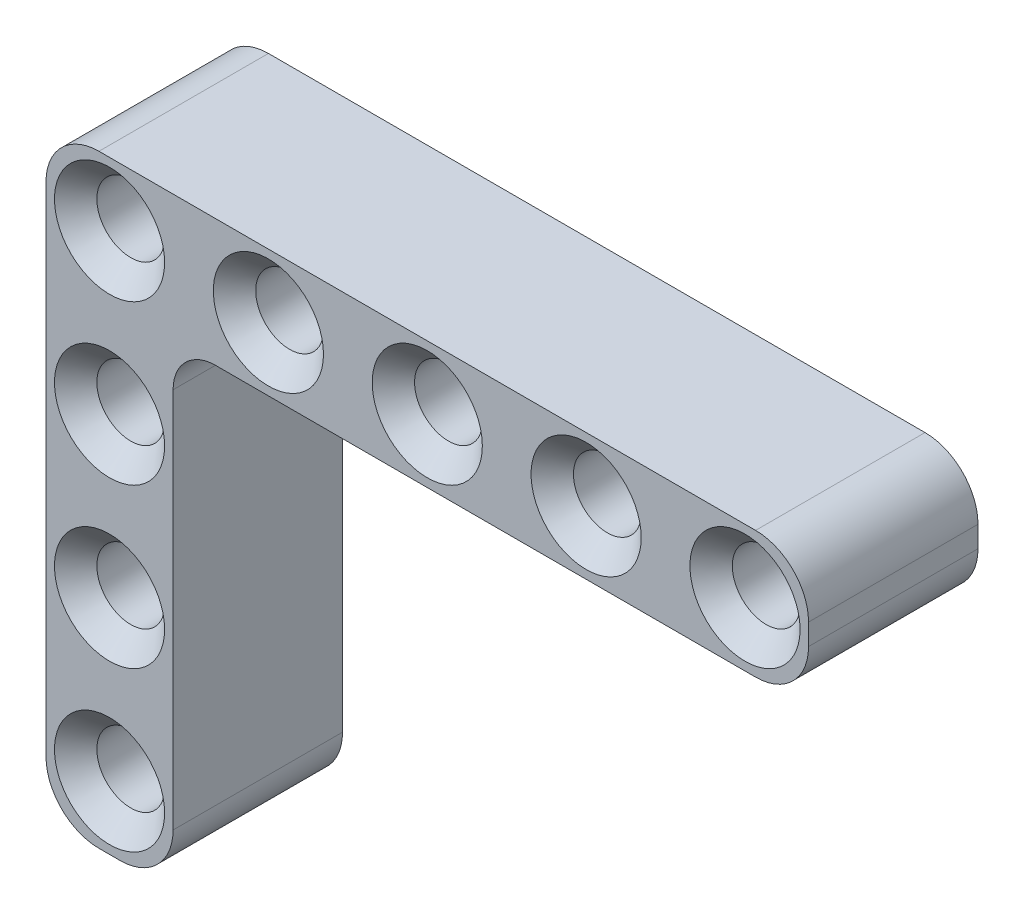
ISO-10303-21;
HEADER;
FILE_DESCRIPTION(('STEP AP214'),'2;1');
FILE_NAME('part.step','',(''),(''),'','','');
FILE_SCHEMA(('AUTOMOTIVE_DESIGN { 1 0 10303 214 1 1 1 1 }'));
ENDSEC;
DATA;
#1=APPLICATION_CONTEXT('core data for automotive mechanical design processes');
#2=APPLICATION_PROTOCOL_DEFINITION('international standard','automotive_design',2000,#1);
#3=PRODUCT_CONTEXT('',#1,'mechanical');
#4=PRODUCT('Part','Part','',(#3));
#5=PRODUCT_RELATED_PRODUCT_CATEGORY('part','',(#4));
#6=PRODUCT_DEFINITION_FORMATION('','',#4);
#7=PRODUCT_DEFINITION_CONTEXT('part definition',#1,'design');
#8=PRODUCT_DEFINITION('design','',#6,#7);
#9=PRODUCT_DEFINITION_SHAPE('','',#8);
#10=(LENGTH_UNIT() NAMED_UNIT(*) SI_UNIT(.MILLI.,.METRE.));
#11=(NAMED_UNIT(*) PLANE_ANGLE_UNIT() SI_UNIT($,.RADIAN.));
#12=(NAMED_UNIT(*) SI_UNIT($,.STERADIAN.) SOLID_ANGLE_UNIT());
#13=UNCERTAINTY_MEASURE_WITH_UNIT(LENGTH_MEASURE(1.E-05),#10,'distance_accuracy_value','');
#14=(GEOMETRIC_REPRESENTATION_CONTEXT(3) GLOBAL_UNCERTAINTY_ASSIGNED_CONTEXT((#13)) GLOBAL_UNIT_ASSIGNED_CONTEXT((#10,
#11,#12)) REPRESENTATION_CONTEXT('',''));
#15=CARTESIAN_POINT('',(0.,0.,0.));
#16=DIRECTION('',(0.,0.,1.));
#17=DIRECTION('',(1.,0.,0.));
#18=AXIS2_PLACEMENT_3D('',#15,#16,#17);
#19=CARTESIAN_POINT('',(30.5,-0.5,8.));
#20=DIRECTION('',(0.,0.,1.));
#21=DIRECTION('',(1.,0.,0.));
#22=AXIS2_PLACEMENT_3D('',#19,#20,#21);
#23=PLANE('',#22);
#24=CARTESIAN_POINT('',(0.,-7.5,8.));
#25=DIRECTION('',(0.,0.,1.));
#26=DIRECTION('',(1.,0.,0.));
#27=AXIS2_PLACEMENT_3D('',#24,#25,#26);
#28=CIRCLE('',#27,2.60000000000001);
#29=CARTESIAN_POINT('',(2.60000000000004,-7.5,8.));
#30=VERTEX_POINT('',#29);
#31=EDGE_CURVE('E294',#30,#30,#28,.F.);
#32=ORIENTED_EDGE('',*,*,#31,.T.);
#33=EDGE_LOOP('',(#32));
#34=FACE_BOUND('',#33,.T.);
#35=CARTESIAN_POINT('',(1.10050857315969E-13,-15.,8.));
#36=DIRECTION('',(0.,0.,1.));
#37=DIRECTION('',(1.,0.,0.));
#38=AXIS2_PLACEMENT_3D('',#35,#36,#37);
#39=CIRCLE('',#38,2.6);
#40=CARTESIAN_POINT('',(2.60000000000012,-15.,8.));
#41=VERTEX_POINT('',#40);
#42=EDGE_CURVE('E291',#41,#41,#39,.F.);
#43=ORIENTED_EDGE('',*,*,#42,.T.);
#44=EDGE_LOOP('',(#43));
#45=FACE_BOUND('',#44,.T.);
#46=CARTESIAN_POINT('',(1.88609187439939E-13,-22.5,8.));
#47=DIRECTION('',(0.,0.,1.));
#48=DIRECTION('',(1.,0.,0.));
#49=AXIS2_PLACEMENT_3D('',#46,#47,#48);
#50=CIRCLE('',#49,2.60000000000001);
#51=CARTESIAN_POINT('',(2.6000000000002,-22.5,8.));
#52=VERTEX_POINT('',#51);
#53=EDGE_CURVE('E288',#52,#52,#50,.F.);
#54=ORIENTED_EDGE('',*,*,#53,.T.);
#55=EDGE_LOOP('',(#54));
#56=FACE_BOUND('',#55,.T.);
#57=CARTESIAN_POINT('',(30.,0.,8.));
#58=DIRECTION('',(0.,0.,1.));
#59=DIRECTION('',(1.,0.,0.));
#60=AXIS2_PLACEMENT_3D('',#57,#58,#59);
#61=CIRCLE('',#60,2.6);
#62=CARTESIAN_POINT('',(32.6,0.,8.));
#63=VERTEX_POINT('',#62);
#64=EDGE_CURVE('E248',#63,#63,#61,.F.);
#65=ORIENTED_EDGE('',*,*,#64,.T.);
#66=EDGE_LOOP('',(#65));
#67=FACE_BOUND('',#66,.T.);
#68=CARTESIAN_POINT('',(22.5,0.,8.));
#69=DIRECTION('',(0.,0.,1.));
#70=DIRECTION('',(1.,0.,0.));
#71=AXIS2_PLACEMENT_3D('',#68,#69,#70);
#72=CIRCLE('',#71,2.6);
#73=CARTESIAN_POINT('',(25.1,0.,8.));
#74=VERTEX_POINT('',#73);
#75=EDGE_CURVE('E245',#74,#74,#72,.F.);
#76=ORIENTED_EDGE('',*,*,#75,.T.);
#77=EDGE_LOOP('',(#76));
#78=FACE_BOUND('',#77,.T.);
#79=CARTESIAN_POINT('',(15.,0.,8.));
#80=DIRECTION('',(0.,0.,1.));
#81=DIRECTION('',(1.,0.,0.));
#82=AXIS2_PLACEMENT_3D('',#79,#80,#81);
#83=CIRCLE('',#82,2.6);
#84=CARTESIAN_POINT('',(17.6,0.,8.));
#85=VERTEX_POINT('',#84);
#86=EDGE_CURVE('E242',#85,#85,#83,.F.);
#87=ORIENTED_EDGE('',*,*,#86,.T.);
#88=EDGE_LOOP('',(#87));
#89=FACE_BOUND('',#88,.T.);
#90=CARTESIAN_POINT('',(7.5,0.,8.));
#91=DIRECTION('',(0.,0.,1.));
#92=DIRECTION('',(1.,0.,0.));
#93=AXIS2_PLACEMENT_3D('',#90,#91,#92);
#94=CIRCLE('',#93,2.6);
#95=CARTESIAN_POINT('',(10.1,0.,8.));
#96=VERTEX_POINT('',#95);
#97=EDGE_CURVE('E239',#96,#96,#94,.F.);
#98=ORIENTED_EDGE('',*,*,#97,.T.);
#99=EDGE_LOOP('',(#98));
#100=FACE_BOUND('',#99,.T.);
#101=CARTESIAN_POINT('',(0.,0.,8.));
#102=DIRECTION('',(0.,0.,1.));
#103=DIRECTION('',(1.,0.,0.));
#104=AXIS2_PLACEMENT_3D('',#101,#102,#103);
#105=CIRCLE('',#104,2.6);
#106=CARTESIAN_POINT('',(2.6,0.,8.));
#107=VERTEX_POINT('',#106);
#108=EDGE_CURVE('E236',#107,#107,#105,.F.);
#109=ORIENTED_EDGE('',*,*,#108,.T.);
#110=EDGE_LOOP('',(#109));
#111=FACE_BOUND('',#110,.T.);
#112=CARTESIAN_POINT('',(30.5,-0.5,8.));
#113=DIRECTION('',(0.,0.,1.));
#114=DIRECTION('',(1.,0.,0.));
#115=AXIS2_PLACEMENT_3D('',#112,#113,#114);
#116=CIRCLE('',#115,2.5);
#117=CARTESIAN_POINT('',(30.5,-3.,8.));
#118=VERTEX_POINT('',#117);
#119=CARTESIAN_POINT('',(33.,-0.5,8.));
#120=VERTEX_POINT('',#119);
#121=EDGE_CURVE('E168',#118,#120,#116,.T.);
#122=ORIENTED_EDGE('',*,*,#121,.T.);
#123=DIRECTION('',(0.,1.,0.));
#124=VECTOR('',#123,1.);
#125=CARTESIAN_POINT('',(33.,0.5,8.));
#126=LINE('',#125,#124);
#127=CARTESIAN_POINT('',(33.,0.5,8.));
#128=VERTEX_POINT('',#127);
#129=EDGE_CURVE('E171',#120,#128,#126,.T.);
#130=ORIENTED_EDGE('',*,*,#129,.T.);
#131=CARTESIAN_POINT('',(30.5,0.5,8.));
#132=DIRECTION('',(0.,0.,1.));
#133=DIRECTION('',(-1.,0.,0.));
#134=AXIS2_PLACEMENT_3D('',#131,#132,#133);
#135=CIRCLE('',#134,2.5);
#136=CARTESIAN_POINT('',(30.5,3.,8.));
#137=VERTEX_POINT('',#136);
#138=EDGE_CURVE('E174',#128,#137,#135,.T.);
#139=ORIENTED_EDGE('',*,*,#138,.T.);
#140=DIRECTION('',(-1.,0.,0.));
#141=VECTOR('',#140,1.);
#142=CARTESIAN_POINT('',(-0.5,3.,8.));
#143=LINE('',#142,#141);
#144=CARTESIAN_POINT('',(-0.5,3.,8.));
#145=VERTEX_POINT('',#144);
#146=EDGE_CURVE('E176',#137,#145,#143,.T.);
#147=ORIENTED_EDGE('',*,*,#146,.T.);
#148=CARTESIAN_POINT('',(-0.5,0.5,8.));
#149=DIRECTION('',(0.,0.,1.));
#150=DIRECTION('',(1.,0.,0.));
#151=AXIS2_PLACEMENT_3D('',#148,#149,#150);
#152=CIRCLE('',#151,2.5);
#153=CARTESIAN_POINT('',(-3.,0.5,8.));
#154=VERTEX_POINT('',#153);
#155=EDGE_CURVE('E178',#145,#154,#152,.T.);
#156=ORIENTED_EDGE('',*,*,#155,.T.);
#157=DIRECTION('',(0.,-1.,0.));
#158=VECTOR('',#157,1.);
#159=CARTESIAN_POINT('',(-3.,0.5,8.));
#160=LINE('',#159,#158);
#161=CARTESIAN_POINT('',(-2.99999999999991,-23.,8.));
#162=VERTEX_POINT('',#161);
#163=EDGE_CURVE('E180',#154,#162,#160,.T.);
#164=ORIENTED_EDGE('',*,*,#163,.T.);
#165=CARTESIAN_POINT('',(-0.499999999999911,-23.,8.));
#166=DIRECTION('',(0.,0.,1.));
#167=DIRECTION('',(1.,0.,0.));
#168=AXIS2_PLACEMENT_3D('',#165,#166,#167);
#169=CIRCLE('',#168,2.5);
#170=CARTESIAN_POINT('',(-0.499999999999901,-25.5,8.));
#171=VERTEX_POINT('',#170);
#172=EDGE_CURVE('E150',#162,#171,#169,.T.);
#173=ORIENTED_EDGE('',*,*,#172,.T.);
#174=DIRECTION('',(1.,0.,0.));
#175=VECTOR('',#174,1.);
#176=CARTESIAN_POINT('',(1.76941794549634E-13,-25.5,8.));
#177=LINE('',#176,#175);
#178=CARTESIAN_POINT('',(0.500000000000099,-25.5,8.));
#179=VERTEX_POINT('',#178);
#180=EDGE_CURVE('E158',#171,#179,#177,.T.);
#181=ORIENTED_EDGE('',*,*,#180,.T.);
#182=CARTESIAN_POINT('',(0.50000000000009,-23.,8.));
#183=DIRECTION('',(0.,0.,1.));
#184=DIRECTION('',(1.,0.,0.));
#185=AXIS2_PLACEMENT_3D('',#182,#183,#184);
#186=CIRCLE('',#185,2.5);
#187=CARTESIAN_POINT('',(3.00000000000009,-23.,8.));
#188=VERTEX_POINT('',#187);
#189=EDGE_CURVE('E129',#179,#188,#186,.T.);
#190=ORIENTED_EDGE('',*,*,#189,.T.);
#191=DIRECTION('',(0.,1.,0.));
#192=VECTOR('',#191,1.);
#193=CARTESIAN_POINT('',(3.,0.,8.));
#194=LINE('',#193,#192);
#195=CARTESIAN_POINT('',(3.00000000000002,-5.00000000000001,8.));
#196=VERTEX_POINT('',#195);
#197=EDGE_CURVE('E153',#188,#196,#194,.T.);
#198=ORIENTED_EDGE('',*,*,#197,.T.);
#199=CARTESIAN_POINT('',(5.00000000000002,-5.,8.));
#200=DIRECTION('',(0.,0.,1.));
#201=DIRECTION('',(1.,0.,0.));
#202=AXIS2_PLACEMENT_3D('',#199,#200,#201);
#203=CIRCLE('',#202,2.);
#204=CARTESIAN_POINT('',(5.00000000000002,-3.,8.));
#205=VERTEX_POINT('',#204);
#206=EDGE_CURVE('E58',#196,#205,#203,.F.);
#207=ORIENTED_EDGE('',*,*,#206,.T.);
#208=DIRECTION('',(1.,0.,0.));
#209=VECTOR('',#208,1.);
#210=CARTESIAN_POINT('',(-0.5,-3.,8.));
#211=LINE('',#210,#209);
#212=EDGE_CURVE('E182',#205,#118,#211,.T.);
#213=ORIENTED_EDGE('',*,*,#212,.T.);
#214=EDGE_LOOP('',(#122,#130,#139,#147,#156,#164,#173,#181,#190,#198,#207,#213));
#215=FACE_BOUND('',#214,.T.);
#216=ADVANCED_FACE('F35',(#34,#45,#56,#67,#78,#89,#100,#111,#215),#23,.T.);
#217=CARTESIAN_POINT('',(30.5,-0.5,0.));
#218=DIRECTION('',(0.,0.,1.));
#219=DIRECTION('',(1.,0.,0.));
#220=AXIS2_PLACEMENT_3D('',#217,#218,#219);
#221=PLANE('',#220);
#222=CARTESIAN_POINT('',(0.,-7.5,0.));
#223=DIRECTION('',(0.,0.,1.));
#224=DIRECTION('',(1.,0.,0.));
#225=AXIS2_PLACEMENT_3D('',#222,#223,#224);
#226=CIRCLE('',#225,2.60000000000001);
#227=CARTESIAN_POINT('',(2.60000000000004,-7.5,0.));
#228=VERTEX_POINT('',#227);
#229=EDGE_CURVE('E303',#228,#228,#226,.T.);
#230=ORIENTED_EDGE('',*,*,#229,.T.);
#231=EDGE_LOOP('',(#230));
#232=FACE_BOUND('',#231,.T.);
#233=CARTESIAN_POINT('',(1.10050857315969E-13,-15.,0.));
#234=DIRECTION('',(0.,0.,1.));
#235=DIRECTION('',(1.,0.,0.));
#236=AXIS2_PLACEMENT_3D('',#233,#234,#235);
#237=CIRCLE('',#236,2.6);
#238=CARTESIAN_POINT('',(2.60000000000012,-15.,0.));
#239=VERTEX_POINT('',#238);
#240=EDGE_CURVE('E300',#239,#239,#237,.T.);
#241=ORIENTED_EDGE('',*,*,#240,.T.);
#242=EDGE_LOOP('',(#241));
#243=FACE_BOUND('',#242,.T.);
#244=CARTESIAN_POINT('',(1.88609187439939E-13,-22.5,0.));
#245=DIRECTION('',(0.,0.,1.));
#246=DIRECTION('',(1.,0.,0.));
#247=AXIS2_PLACEMENT_3D('',#244,#245,#246);
#248=CIRCLE('',#247,2.59999999999999);
#249=CARTESIAN_POINT('',(2.60000000000018,-22.5,0.));
#250=VERTEX_POINT('',#249);
#251=EDGE_CURVE('E297',#250,#250,#248,.T.);
#252=ORIENTED_EDGE('',*,*,#251,.T.);
#253=EDGE_LOOP('',(#252));
#254=FACE_BOUND('',#253,.T.);
#255=CARTESIAN_POINT('',(30.,0.,0.));
#256=DIRECTION('',(0.,0.,1.));
#257=DIRECTION('',(1.,0.,0.));
#258=AXIS2_PLACEMENT_3D('',#255,#256,#257);
#259=CIRCLE('',#258,2.6);
#260=CARTESIAN_POINT('',(32.6,0.,0.));
#261=VERTEX_POINT('',#260);
#262=EDGE_CURVE('E227',#261,#261,#259,.T.);
#263=ORIENTED_EDGE('',*,*,#262,.T.);
#264=EDGE_LOOP('',(#263));
#265=FACE_BOUND('',#264,.T.);
#266=CARTESIAN_POINT('',(22.5,0.,0.));
#267=DIRECTION('',(0.,0.,1.));
#268=DIRECTION('',(1.,0.,0.));
#269=AXIS2_PLACEMENT_3D('',#266,#267,#268);
#270=CIRCLE('',#269,2.59999999999999);
#271=CARTESIAN_POINT('',(25.1,0.,0.));
#272=VERTEX_POINT('',#271);
#273=EDGE_CURVE('E224',#272,#272,#270,.T.);
#274=ORIENTED_EDGE('',*,*,#273,.T.);
#275=EDGE_LOOP('',(#274));
#276=FACE_BOUND('',#275,.T.);
#277=CARTESIAN_POINT('',(15.,0.,0.));
#278=DIRECTION('',(0.,0.,1.));
#279=DIRECTION('',(1.,0.,0.));
#280=AXIS2_PLACEMENT_3D('',#277,#278,#279);
#281=CIRCLE('',#280,2.59999999999999);
#282=CARTESIAN_POINT('',(17.6,0.,0.));
#283=VERTEX_POINT('',#282);
#284=EDGE_CURVE('E221',#283,#283,#281,.T.);
#285=ORIENTED_EDGE('',*,*,#284,.T.);
#286=EDGE_LOOP('',(#285));
#287=FACE_BOUND('',#286,.T.);
#288=CARTESIAN_POINT('',(7.5,0.,0.));
#289=DIRECTION('',(0.,0.,1.));
#290=DIRECTION('',(1.,0.,0.));
#291=AXIS2_PLACEMENT_3D('',#288,#289,#290);
#292=CIRCLE('',#291,2.6);
#293=CARTESIAN_POINT('',(10.1,0.,0.));
#294=VERTEX_POINT('',#293);
#295=EDGE_CURVE('E218',#294,#294,#292,.T.);
#296=ORIENTED_EDGE('',*,*,#295,.T.);
#297=EDGE_LOOP('',(#296));
#298=FACE_BOUND('',#297,.T.);
#299=CARTESIAN_POINT('',(0.,0.,0.));
#300=DIRECTION('',(0.,0.,1.));
#301=DIRECTION('',(1.,0.,0.));
#302=AXIS2_PLACEMENT_3D('',#299,#300,#301);
#303=CIRCLE('',#302,2.6);
#304=CARTESIAN_POINT('',(2.6,0.,0.));
#305=VERTEX_POINT('',#304);
#306=EDGE_CURVE('E215',#305,#305,#303,.T.);
#307=ORIENTED_EDGE('',*,*,#306,.T.);
#308=EDGE_LOOP('',(#307));
#309=FACE_BOUND('',#308,.T.);
#310=CARTESIAN_POINT('',(30.5,-0.5,0.));
#311=DIRECTION('',(0.,0.,1.));
#312=DIRECTION('',(1.,0.,0.));
#313=AXIS2_PLACEMENT_3D('',#310,#311,#312);
#314=CIRCLE('',#313,2.5);
#315=CARTESIAN_POINT('',(30.5,-3.,0.));
#316=VERTEX_POINT('',#315);
#317=CARTESIAN_POINT('',(33.,-0.5,0.));
#318=VERTEX_POINT('',#317);
#319=EDGE_CURVE('E163',#316,#318,#314,.T.);
#320=ORIENTED_EDGE('',*,*,#319,.F.);
#321=DIRECTION('',(1.,0.,0.));
#322=VECTOR('',#321,1.);
#323=CARTESIAN_POINT('',(-0.5,-3.,0.));
#324=LINE('',#323,#322);
#325=CARTESIAN_POINT('',(5.00000000000002,-3.,0.));
#326=VERTEX_POINT('',#325);
#327=EDGE_CURVE('E172',#326,#316,#324,.T.);
#328=ORIENTED_EDGE('',*,*,#327,.F.);
#329=CARTESIAN_POINT('',(5.00000000000002,-5.,0.));
#330=DIRECTION('',(0.,0.,1.));
#331=DIRECTION('',(1.,0.,0.));
#332=AXIS2_PLACEMENT_3D('',#329,#330,#331);
#333=CIRCLE('',#332,2.);
#334=CARTESIAN_POINT('',(3.00000000000002,-5.00000000000001,0.));
#335=VERTEX_POINT('',#334);
#336=EDGE_CURVE('E280',#326,#335,#333,.T.);
#337=ORIENTED_EDGE('',*,*,#336,.T.);
#338=DIRECTION('',(0.,1.,0.));
#339=VECTOR('',#338,1.);
#340=CARTESIAN_POINT('',(3.,0.,0.));
#341=LINE('',#340,#339);
#342=CARTESIAN_POINT('',(3.00000000000009,-23.,0.));
#343=VERTEX_POINT('',#342);
#344=EDGE_CURVE('E146',#343,#335,#341,.T.);
#345=ORIENTED_EDGE('',*,*,#344,.F.);
#346=CARTESIAN_POINT('',(0.50000000000009,-23.,0.));
#347=DIRECTION('',(0.,0.,1.));
#348=DIRECTION('',(1.,0.,0.));
#349=AXIS2_PLACEMENT_3D('',#346,#347,#348);
#350=CIRCLE('',#349,2.5);
#351=CARTESIAN_POINT('',(0.500000000000099,-25.5,0.));
#352=VERTEX_POINT('',#351);
#353=EDGE_CURVE('E127',#352,#343,#350,.T.);
#354=ORIENTED_EDGE('',*,*,#353,.F.);
#355=DIRECTION('',(1.,0.,0.));
#356=VECTOR('',#355,1.);
#357=CARTESIAN_POINT('',(1.76941794549634E-13,-25.5,0.));
#358=LINE('',#357,#356);
#359=CARTESIAN_POINT('',(-0.499999999999901,-25.5,0.));
#360=VERTEX_POINT('',#359);
#361=EDGE_CURVE('E143',#360,#352,#358,.T.);
#362=ORIENTED_EDGE('',*,*,#361,.F.);
#363=CARTESIAN_POINT('',(-0.499999999999911,-23.,0.));
#364=DIRECTION('',(0.,0.,1.));
#365=DIRECTION('',(1.,0.,0.));
#366=AXIS2_PLACEMENT_3D('',#363,#364,#365);
#367=CIRCLE('',#366,2.5);
#368=CARTESIAN_POINT('',(-2.99999999999991,-23.,0.));
#369=VERTEX_POINT('',#368);
#370=EDGE_CURVE('E135',#369,#360,#367,.T.);
#371=ORIENTED_EDGE('',*,*,#370,.F.);
#372=DIRECTION('',(0.,-1.,0.));
#373=VECTOR('',#372,1.);
#374=CARTESIAN_POINT('',(-3.,0.5,0.));
#375=LINE('',#374,#373);
#376=CARTESIAN_POINT('',(-3.,0.5,0.));
#377=VERTEX_POINT('',#376);
#378=EDGE_CURVE('E195',#377,#369,#375,.T.);
#379=ORIENTED_EDGE('',*,*,#378,.F.);
#380=CARTESIAN_POINT('',(-0.5,0.5,0.));
#381=DIRECTION('',(0.,0.,1.));
#382=DIRECTION('',(1.,0.,0.));
#383=AXIS2_PLACEMENT_3D('',#380,#381,#382);
#384=CIRCLE('',#383,2.5);
#385=CARTESIAN_POINT('',(-0.5,3.,0.));
#386=VERTEX_POINT('',#385);
#387=EDGE_CURVE('E193',#386,#377,#384,.T.);
#388=ORIENTED_EDGE('',*,*,#387,.F.);
#389=DIRECTION('',(-1.,0.,0.));
#390=VECTOR('',#389,1.);
#391=CARTESIAN_POINT('',(-0.5,3.,0.));
#392=LINE('',#391,#390);
#393=CARTESIAN_POINT('',(30.5,3.,0.));
#394=VERTEX_POINT('',#393);
#395=EDGE_CURVE('E191',#394,#386,#392,.T.);
#396=ORIENTED_EDGE('',*,*,#395,.F.);
#397=CARTESIAN_POINT('',(30.5,0.5,0.));
#398=DIRECTION('',(0.,0.,1.));
#399=DIRECTION('',(-1.,0.,0.));
#400=AXIS2_PLACEMENT_3D('',#397,#398,#399);
#401=CIRCLE('',#400,2.5);
#402=CARTESIAN_POINT('',(33.,0.5,0.));
#403=VERTEX_POINT('',#402);
#404=EDGE_CURVE('E189',#403,#394,#401,.T.);
#405=ORIENTED_EDGE('',*,*,#404,.F.);
#406=DIRECTION('',(0.,1.,0.));
#407=VECTOR('',#406,1.);
#408=CARTESIAN_POINT('',(33.,0.5,0.));
#409=LINE('',#408,#407);
#410=EDGE_CURVE('E187',#318,#403,#409,.T.);
#411=ORIENTED_EDGE('',*,*,#410,.F.);
#412=EDGE_LOOP('',(#320,#328,#337,#345,#354,#362,#371,#379,#388,#396,#405,#411));
#413=FACE_BOUND('',#412,.T.);
#414=ADVANCED_FACE('F141',(#232,#243,#254,#265,#276,#287,#298,#309,#413),#221,.F.);
#415=CARTESIAN_POINT('',(30.5,-0.5,8.));
#416=DIRECTION('',(0.,0.,-1.));
#417=DIRECTION('',(-1.,0.,0.));
#418=AXIS2_PLACEMENT_3D('',#415,#416,#417);
#419=CYLINDRICAL_SURFACE('',#418,2.5);
#420=ORIENTED_EDGE('',*,*,#319,.T.);
#421=DIRECTION('',(0.,0.,-1.));
#422=VECTOR('',#421,1.);
#423=CARTESIAN_POINT('',(33.,-0.5,8.));
#424=LINE('',#423,#422);
#425=EDGE_CURVE('E212',#120,#318,#424,.T.);
#426=ORIENTED_EDGE('',*,*,#425,.F.);
#427=ORIENTED_EDGE('',*,*,#121,.F.);
#428=DIRECTION('',(0.,0.,-1.));
#429=VECTOR('',#428,1.);
#430=CARTESIAN_POINT('',(30.5,-3.,8.));
#431=LINE('',#430,#429);
#432=EDGE_CURVE('E184',#118,#316,#431,.T.);
#433=ORIENTED_EDGE('',*,*,#432,.T.);
#434=EDGE_LOOP('',(#420,#426,#427,#433));
#435=FACE_BOUND('',#434,.T.);
#436=ADVANCED_FACE('F323',(#435),#419,.T.);
#437=CARTESIAN_POINT('',(33.,0.5,8.));
#438=DIRECTION('',(-1.,0.,0.));
#439=DIRECTION('',(0.,0.,1.));
#440=AXIS2_PLACEMENT_3D('',#437,#438,#439);
#441=PLANE('',#440);
#442=ORIENTED_EDGE('',*,*,#410,.T.);
#443=DIRECTION('',(0.,0.,-1.));
#444=VECTOR('',#443,1.);
#445=CARTESIAN_POINT('',(33.,0.5,8.));
#446=LINE('',#445,#444);
#447=EDGE_CURVE('E209',#128,#403,#446,.T.);
#448=ORIENTED_EDGE('',*,*,#447,.F.);
#449=ORIENTED_EDGE('',*,*,#129,.F.);
#450=ORIENTED_EDGE('',*,*,#425,.T.);
#451=EDGE_LOOP('',(#442,#448,#449,#450));
#452=FACE_BOUND('',#451,.T.);
#453=ADVANCED_FACE('F380',(#452),#441,.F.);
#454=CARTESIAN_POINT('',(30.5,0.5,8.));
#455=DIRECTION('',(0.,0.,-1.));
#456=DIRECTION('',(-1.,0.,0.));
#457=AXIS2_PLACEMENT_3D('',#454,#455,#456);
#458=CYLINDRICAL_SURFACE('',#457,2.5);
#459=ORIENTED_EDGE('',*,*,#404,.T.);
#460=DIRECTION('',(0.,0.,-1.));
#461=VECTOR('',#460,1.);
#462=CARTESIAN_POINT('',(30.5,3.,8.));
#463=LINE('',#462,#461);
#464=EDGE_CURVE('E206',#137,#394,#463,.T.);
#465=ORIENTED_EDGE('',*,*,#464,.F.);
#466=ORIENTED_EDGE('',*,*,#138,.F.);
#467=ORIENTED_EDGE('',*,*,#447,.T.);
#468=EDGE_LOOP('',(#459,#465,#466,#467));
#469=FACE_BOUND('',#468,.T.);
#470=ADVANCED_FACE('F376',(#469),#458,.T.);
#471=CARTESIAN_POINT('',(-0.5,3.,8.));
#472=DIRECTION('',(0.,-1.,0.));
#473=DIRECTION('',(1.,0.,0.));
#474=AXIS2_PLACEMENT_3D('',#471,#472,#473);
#475=PLANE('',#474);
#476=ORIENTED_EDGE('',*,*,#395,.T.);
#477=DIRECTION('',(0.,0.,-1.));
#478=VECTOR('',#477,1.);
#479=CARTESIAN_POINT('',(-0.5,3.,8.));
#480=LINE('',#479,#478);
#481=EDGE_CURVE('E203',#145,#386,#480,.T.);
#482=ORIENTED_EDGE('',*,*,#481,.F.);
#483=ORIENTED_EDGE('',*,*,#146,.F.);
#484=ORIENTED_EDGE('',*,*,#464,.T.);
#485=EDGE_LOOP('',(#476,#482,#483,#484));
#486=FACE_BOUND('',#485,.T.);
#487=ADVANCED_FACE('F372',(#486),#475,.F.);
#488=CARTESIAN_POINT('',(-0.5,0.5,8.));
#489=DIRECTION('',(0.,0.,-1.));
#490=DIRECTION('',(-1.,0.,0.));
#491=AXIS2_PLACEMENT_3D('',#488,#489,#490);
#492=CYLINDRICAL_SURFACE('',#491,2.5);
#493=ORIENTED_EDGE('',*,*,#387,.T.);
#494=DIRECTION('',(0.,0.,-1.));
#495=VECTOR('',#494,1.);
#496=CARTESIAN_POINT('',(-3.,0.5,8.));
#497=LINE('',#496,#495);
#498=EDGE_CURVE('E200',#154,#377,#497,.T.);
#499=ORIENTED_EDGE('',*,*,#498,.F.);
#500=ORIENTED_EDGE('',*,*,#155,.F.);
#501=ORIENTED_EDGE('',*,*,#481,.T.);
#502=EDGE_LOOP('',(#493,#499,#500,#501));
#503=FACE_BOUND('',#502,.T.);
#504=ADVANCED_FACE('F368',(#503),#492,.T.);
#505=CARTESIAN_POINT('',(-3.,0.5,8.));
#506=DIRECTION('',(1.,0.,0.));
#507=DIRECTION('',(0.,0.,-1.));
#508=AXIS2_PLACEMENT_3D('',#505,#506,#507);
#509=PLANE('',#508);
#510=ORIENTED_EDGE('',*,*,#378,.T.);
#511=DIRECTION('',(0.,0.,1.));
#512=VECTOR('',#511,1.);
#513=CARTESIAN_POINT('',(-2.99999999999991,-23.,0.));
#514=LINE('',#513,#512);
#515=EDGE_CURVE('E164',#369,#162,#514,.T.);
#516=ORIENTED_EDGE('',*,*,#515,.T.);
#517=ORIENTED_EDGE('',*,*,#163,.F.);
#518=ORIENTED_EDGE('',*,*,#498,.T.);
#519=EDGE_LOOP('',(#510,#516,#517,#518));
#520=FACE_BOUND('',#519,.T.);
#521=ADVANCED_FACE('F365',(#520),#509,.F.);
#522=CARTESIAN_POINT('',(-0.5,-3.,8.));
#523=DIRECTION('',(0.,1.,0.));
#524=DIRECTION('',(-1.,0.,0.));
#525=AXIS2_PLACEMENT_3D('',#522,#523,#524);
#526=PLANE('',#525);
#527=ORIENTED_EDGE('',*,*,#212,.F.);
#528=DIRECTION('',(0.,0.,1.));
#529=VECTOR('',#528,1.);
#530=CARTESIAN_POINT('',(5.00000000000002,-3.,8.));
#531=LINE('',#530,#529);
#532=EDGE_CURVE('E50',#205,#326,#531,.F.);
#533=ORIENTED_EDGE('',*,*,#532,.T.);
#534=ORIENTED_EDGE('',*,*,#327,.T.);
#535=ORIENTED_EDGE('',*,*,#432,.F.);
#536=EDGE_LOOP('',(#527,#533,#534,#535));
#537=FACE_BOUND('',#536,.T.);
#538=ADVANCED_FACE('F362',(#537),#526,.F.);
#539=CARTESIAN_POINT('',(0.,0.,8.));
#540=DIRECTION('',(0.,0.,-1.));
#541=DIRECTION('',(-1.,0.,0.));
#542=AXIS2_PLACEMENT_3D('',#539,#540,#541);
#543=CYLINDRICAL_SURFACE('',#542,1.6);
#544=CARTESIAN_POINT('',(0.,0.,1.00000000000001));
#545=DIRECTION('',(0.,0.,1.));
#546=DIRECTION('',(1.,0.,0.));
#547=AXIS2_PLACEMENT_3D('',#544,#545,#546);
#548=CIRCLE('',#547,1.6);
#549=CARTESIAN_POINT('',(1.6,0.,1.00000000000001));
#550=VERTEX_POINT('',#549);
#551=EDGE_CURVE('E272',#550,#550,#548,.F.);
#552=ORIENTED_EDGE('',*,*,#551,.T.);
#553=EDGE_LOOP('',(#552));
#554=FACE_BOUND('',#553,.T.);
#555=CARTESIAN_POINT('',(0.,0.,7.));
#556=DIRECTION('',(0.,0.,1.));
#557=DIRECTION('',(1.,0.,0.));
#558=AXIS2_PLACEMENT_3D('',#555,#556,#557);
#559=CIRCLE('',#558,1.6);
#560=CARTESIAN_POINT('',(1.6,0.,7.));
#561=VERTEX_POINT('',#560);
#562=EDGE_CURVE('E269',#561,#561,#559,.T.);
#563=ORIENTED_EDGE('',*,*,#562,.T.);
#564=EDGE_LOOP('',(#563));
#565=FACE_BOUND('',#564,.T.);
#566=ADVANCED_FACE('F359',(#554,#565),#543,.F.);
#567=CARTESIAN_POINT('',(7.5,0.,8.));
#568=DIRECTION('',(0.,0.,-1.));
#569=DIRECTION('',(-1.,0.,0.));
#570=AXIS2_PLACEMENT_3D('',#567,#568,#569);
#571=CYLINDRICAL_SURFACE('',#570,1.6);
#572=CARTESIAN_POINT('',(7.5,0.,1.));
#573=DIRECTION('',(0.,0.,1.));
#574=DIRECTION('',(1.,0.,0.));
#575=AXIS2_PLACEMENT_3D('',#572,#573,#574);
#576=CIRCLE('',#575,1.6);
#577=CARTESIAN_POINT('',(9.1,0.,1.));
#578=VERTEX_POINT('',#577);
#579=EDGE_CURVE('E266',#578,#578,#576,.F.);
#580=ORIENTED_EDGE('',*,*,#579,.T.);
#581=EDGE_LOOP('',(#580));
#582=FACE_BOUND('',#581,.T.);
#583=CARTESIAN_POINT('',(7.5,0.,7.00000000000001));
#584=DIRECTION('',(0.,0.,1.));
#585=DIRECTION('',(1.,0.,0.));
#586=AXIS2_PLACEMENT_3D('',#583,#584,#585);
#587=CIRCLE('',#586,1.6);
#588=CARTESIAN_POINT('',(9.1,0.,7.00000000000001));
#589=VERTEX_POINT('',#588);
#590=EDGE_CURVE('E263',#589,#589,#587,.T.);
#591=ORIENTED_EDGE('',*,*,#590,.T.);
#592=EDGE_LOOP('',(#591));
#593=FACE_BOUND('',#592,.T.);
#594=ADVANCED_FACE('F420',(#582,#593),#571,.F.);
#595=CARTESIAN_POINT('',(15.,0.,8.));
#596=DIRECTION('',(0.,0.,-1.));
#597=DIRECTION('',(-1.,0.,0.));
#598=AXIS2_PLACEMENT_3D('',#595,#596,#597);
#599=CYLINDRICAL_SURFACE('',#598,1.6);
#600=CARTESIAN_POINT('',(15.,0.,0.999999999999997));
#601=DIRECTION('',(0.,0.,1.));
#602=DIRECTION('',(1.,0.,0.));
#603=AXIS2_PLACEMENT_3D('',#600,#601,#602);
#604=CIRCLE('',#603,1.6);
#605=CARTESIAN_POINT('',(16.6,0.,0.999999999999997));
#606=VERTEX_POINT('',#605);
#607=EDGE_CURVE('E260',#606,#606,#604,.F.);
#608=ORIENTED_EDGE('',*,*,#607,.T.);
#609=EDGE_LOOP('',(#608));
#610=FACE_BOUND('',#609,.T.);
#611=CARTESIAN_POINT('',(15.,0.,7.));
#612=DIRECTION('',(0.,0.,1.));
#613=DIRECTION('',(1.,0.,0.));
#614=AXIS2_PLACEMENT_3D('',#611,#612,#613);
#615=CIRCLE('',#614,1.6);
#616=CARTESIAN_POINT('',(16.6,0.,7.));
#617=VERTEX_POINT('',#616);
#618=EDGE_CURVE('E257',#617,#617,#615,.T.);
#619=ORIENTED_EDGE('',*,*,#618,.T.);
#620=EDGE_LOOP('',(#619));
#621=FACE_BOUND('',#620,.T.);
#622=ADVANCED_FACE('F423',(#610,#621),#599,.F.);
#623=CARTESIAN_POINT('',(22.5,0.,8.));
#624=DIRECTION('',(0.,0.,-1.));
#625=DIRECTION('',(-1.,0.,0.));
#626=AXIS2_PLACEMENT_3D('',#623,#624,#625);
#627=CYLINDRICAL_SURFACE('',#626,1.6);
#628=CARTESIAN_POINT('',(22.5,0.,0.999999999999997));
#629=DIRECTION('',(0.,0.,1.));
#630=DIRECTION('',(1.,0.,0.));
#631=AXIS2_PLACEMENT_3D('',#628,#629,#630);
#632=CIRCLE('',#631,1.6);
#633=CARTESIAN_POINT('',(24.1,0.,0.999999999999997));
#634=VERTEX_POINT('',#633);
#635=EDGE_CURVE('E254',#634,#634,#632,.F.);
#636=ORIENTED_EDGE('',*,*,#635,.T.);
#637=EDGE_LOOP('',(#636));
#638=FACE_BOUND('',#637,.T.);
#639=CARTESIAN_POINT('',(22.5,0.,7.));
#640=DIRECTION('',(0.,0.,1.));
#641=DIRECTION('',(1.,0.,0.));
#642=AXIS2_PLACEMENT_3D('',#639,#640,#641);
#643=CIRCLE('',#642,1.6);
#644=CARTESIAN_POINT('',(24.1,0.,7.));
#645=VERTEX_POINT('',#644);
#646=EDGE_CURVE('E251',#645,#645,#643,.T.);
#647=ORIENTED_EDGE('',*,*,#646,.T.);
#648=EDGE_LOOP('',(#647));
#649=FACE_BOUND('',#648,.T.);
#650=ADVANCED_FACE('F430',(#638,#649),#627,.F.);
#651=CARTESIAN_POINT('',(30.,0.,8.));
#652=DIRECTION('',(0.,0.,-1.));
#653=DIRECTION('',(-1.,0.,0.));
#654=AXIS2_PLACEMENT_3D('',#651,#652,#653);
#655=CYLINDRICAL_SURFACE('',#654,1.6);
#656=CARTESIAN_POINT('',(30.,0.,0.999999999999997));
#657=DIRECTION('',(0.,0.,1.));
#658=DIRECTION('',(1.,0.,0.));
#659=AXIS2_PLACEMENT_3D('',#656,#657,#658);
#660=CIRCLE('',#659,1.6);
#661=CARTESIAN_POINT('',(31.6,0.,0.999999999999997));
#662=VERTEX_POINT('',#661);
#663=EDGE_CURVE('E233',#662,#662,#660,.F.);
#664=ORIENTED_EDGE('',*,*,#663,.T.);
#665=EDGE_LOOP('',(#664));
#666=FACE_BOUND('',#665,.T.);
#667=CARTESIAN_POINT('',(30.,0.,7.));
#668=DIRECTION('',(0.,0.,1.));
#669=DIRECTION('',(1.,0.,0.));
#670=AXIS2_PLACEMENT_3D('',#667,#668,#669);
#671=CIRCLE('',#670,1.6);
#672=CARTESIAN_POINT('',(31.6,0.,7.));
#673=VERTEX_POINT('',#672);
#674=EDGE_CURVE('E230',#673,#673,#671,.T.);
#675=ORIENTED_EDGE('',*,*,#674,.T.);
#676=EDGE_LOOP('',(#675));
#677=FACE_BOUND('',#676,.T.);
#678=ADVANCED_FACE('F392',(#666,#677),#655,.F.);
#679=CARTESIAN_POINT('',(30.,0.,0.));
#680=DIRECTION('',(0.,0.,-1.));
#681=DIRECTION('',(-1.,0.,0.));
#682=AXIS2_PLACEMENT_3D('',#679,#680,#681);
#683=CONICAL_SURFACE('',#682,2.59999999999999,0.785398163397448);
#684=ORIENTED_EDGE('',*,*,#663,.F.);
#685=EDGE_LOOP('',(#684));
#686=FACE_BOUND('',#685,.T.);
#687=ORIENTED_EDGE('',*,*,#262,.F.);
#688=EDGE_LOOP('',(#687));
#689=FACE_BOUND('',#688,.T.);
#690=ADVANCED_FACE('F388',(#686,#689),#683,.F.);
#691=CARTESIAN_POINT('',(30.,0.,7.));
#692=DIRECTION('',(0.,0.,1.));
#693=DIRECTION('',(1.,0.,0.));
#694=AXIS2_PLACEMENT_3D('',#691,#692,#693);
#695=CONICAL_SURFACE('',#694,1.6,0.78539816339745);
#696=ORIENTED_EDGE('',*,*,#64,.F.);
#697=EDGE_LOOP('',(#696));
#698=FACE_BOUND('',#697,.T.);
#699=ORIENTED_EDGE('',*,*,#674,.F.);
#700=EDGE_LOOP('',(#699));
#701=FACE_BOUND('',#700,.T.);
#702=ADVANCED_FACE('F391',(#698,#701),#695,.F.);
#703=CARTESIAN_POINT('',(22.5,0.,0.));
#704=DIRECTION('',(0.,0.,-1.));
#705=DIRECTION('',(-1.,0.,0.));
#706=AXIS2_PLACEMENT_3D('',#703,#704,#705);
#707=CONICAL_SURFACE('',#706,2.59999999999999,0.785398163397448);
#708=ORIENTED_EDGE('',*,*,#635,.F.);
#709=EDGE_LOOP('',(#708));
#710=FACE_BOUND('',#709,.T.);
#711=ORIENTED_EDGE('',*,*,#273,.F.);
#712=EDGE_LOOP('',(#711));
#713=FACE_BOUND('',#712,.T.);
#714=ADVANCED_FACE('F396',(#710,#713),#707,.F.);
#715=CARTESIAN_POINT('',(22.5,0.,7.));
#716=DIRECTION('',(0.,0.,1.));
#717=DIRECTION('',(1.,0.,0.));
#718=AXIS2_PLACEMENT_3D('',#715,#716,#717);
#719=CONICAL_SURFACE('',#718,1.6,0.78539816339745);
#720=ORIENTED_EDGE('',*,*,#75,.F.);
#721=EDGE_LOOP('',(#720));
#722=FACE_BOUND('',#721,.T.);
#723=ORIENTED_EDGE('',*,*,#646,.F.);
#724=EDGE_LOOP('',(#723));
#725=FACE_BOUND('',#724,.T.);
#726=ADVANCED_FACE('F400',(#722,#725),#719,.F.);
#727=CARTESIAN_POINT('',(15.,0.,0.));
#728=DIRECTION('',(0.,0.,-1.));
#729=DIRECTION('',(-1.,0.,0.));
#730=AXIS2_PLACEMENT_3D('',#727,#728,#729);
#731=CONICAL_SURFACE('',#730,2.59999999999999,0.785398163397448);
#732=ORIENTED_EDGE('',*,*,#607,.F.);
#733=EDGE_LOOP('',(#732));
#734=FACE_BOUND('',#733,.T.);
#735=ORIENTED_EDGE('',*,*,#284,.F.);
#736=EDGE_LOOP('',(#735));
#737=FACE_BOUND('',#736,.T.);
#738=ADVANCED_FACE('F404',(#734,#737),#731,.F.);
#739=CARTESIAN_POINT('',(15.,0.,7.));
#740=DIRECTION('',(0.,0.,1.));
#741=DIRECTION('',(1.,0.,0.));
#742=AXIS2_PLACEMENT_3D('',#739,#740,#741);
#743=CONICAL_SURFACE('',#742,1.6,0.78539816339745);
#744=ORIENTED_EDGE('',*,*,#86,.F.);
#745=EDGE_LOOP('',(#744));
#746=FACE_BOUND('',#745,.T.);
#747=ORIENTED_EDGE('',*,*,#618,.F.);
#748=EDGE_LOOP('',(#747));
#749=FACE_BOUND('',#748,.T.);
#750=ADVANCED_FACE('F408',(#746,#749),#743,.F.);
#751=CARTESIAN_POINT('',(7.5,0.,0.));
#752=DIRECTION('',(0.,0.,-1.));
#753=DIRECTION('',(-1.,0.,0.));
#754=AXIS2_PLACEMENT_3D('',#751,#752,#753);
#755=CONICAL_SURFACE('',#754,2.6,0.785398163397448);
#756=ORIENTED_EDGE('',*,*,#579,.F.);
#757=EDGE_LOOP('',(#756));
#758=FACE_BOUND('',#757,.T.);
#759=ORIENTED_EDGE('',*,*,#295,.F.);
#760=EDGE_LOOP('',(#759));
#761=FACE_BOUND('',#760,.T.);
#762=ADVANCED_FACE('F348',(#758,#761),#755,.F.);
#763=CARTESIAN_POINT('',(7.5,0.,7.00000000000001));
#764=DIRECTION('',(0.,0.,1.));
#765=DIRECTION('',(1.,0.,0.));
#766=AXIS2_PLACEMENT_3D('',#763,#764,#765);
#767=CONICAL_SURFACE('',#766,1.6,0.785398163397449);
#768=ORIENTED_EDGE('',*,*,#97,.F.);
#769=EDGE_LOOP('',(#768));
#770=FACE_BOUND('',#769,.T.);
#771=ORIENTED_EDGE('',*,*,#590,.F.);
#772=EDGE_LOOP('',(#771));
#773=FACE_BOUND('',#772,.T.);
#774=ADVANCED_FACE('F339',(#770,#773),#767,.F.);
#775=CARTESIAN_POINT('',(0.,0.,0.));
#776=DIRECTION('',(0.,0.,-1.));
#777=DIRECTION('',(-1.,0.,0.));
#778=AXIS2_PLACEMENT_3D('',#775,#776,#777);
#779=CONICAL_SURFACE('',#778,2.6,0.785398163397448);
#780=ORIENTED_EDGE('',*,*,#551,.F.);
#781=EDGE_LOOP('',(#780));
#782=FACE_BOUND('',#781,.T.);
#783=ORIENTED_EDGE('',*,*,#306,.F.);
#784=EDGE_LOOP('',(#783));
#785=FACE_BOUND('',#784,.T.);
#786=ADVANCED_FACE('F336',(#782,#785),#779,.F.);
#787=CARTESIAN_POINT('',(0.,0.,7.));
#788=DIRECTION('',(0.,0.,1.));
#789=DIRECTION('',(1.,0.,0.));
#790=AXIS2_PLACEMENT_3D('',#787,#788,#789);
#791=CONICAL_SURFACE('',#790,1.6,0.785398163397449);
#792=ORIENTED_EDGE('',*,*,#108,.F.);
#793=EDGE_LOOP('',(#792));
#794=FACE_BOUND('',#793,.T.);
#795=ORIENTED_EDGE('',*,*,#562,.F.);
#796=EDGE_LOOP('',(#795));
#797=FACE_BOUND('',#796,.T.);
#798=ADVANCED_FACE('F338',(#794,#797),#791,.F.);
#799=CARTESIAN_POINT('',(1.76941794549634E-13,-25.5,0.));
#800=DIRECTION('',(0.,-1.,0.));
#801=DIRECTION('',(1.,0.,0.));
#802=AXIS2_PLACEMENT_3D('',#799,#800,#801);
#803=PLANE('',#802);
#804=ORIENTED_EDGE('',*,*,#180,.F.);
#805=DIRECTION('',(0.,0.,1.));
#806=VECTOR('',#805,1.);
#807=CARTESIAN_POINT('',(-0.499999999999901,-25.5,0.));
#808=LINE('',#807,#806);
#809=EDGE_CURVE('E149',#360,#171,#808,.T.);
#810=ORIENTED_EDGE('',*,*,#809,.F.);
#811=ORIENTED_EDGE('',*,*,#361,.T.);
#812=DIRECTION('',(0.,0.,1.));
#813=VECTOR('',#812,1.);
#814=CARTESIAN_POINT('',(0.500000000000099,-25.5,0.));
#815=LINE('',#814,#813);
#816=EDGE_CURVE('E124',#352,#179,#815,.T.);
#817=ORIENTED_EDGE('',*,*,#816,.T.);
#818=EDGE_LOOP('',(#804,#810,#811,#817));
#819=FACE_BOUND('',#818,.T.);
#820=ADVANCED_FACE('F148',(#819),#803,.T.);
#821=CARTESIAN_POINT('',(-0.499999999999911,-23.,0.));
#822=DIRECTION('',(0.,0.,1.));
#823=DIRECTION('',(1.,0.,0.));
#824=AXIS2_PLACEMENT_3D('',#821,#822,#823);
#825=CYLINDRICAL_SURFACE('',#824,2.5);
#826=ORIENTED_EDGE('',*,*,#172,.F.);
#827=ORIENTED_EDGE('',*,*,#515,.F.);
#828=ORIENTED_EDGE('',*,*,#370,.T.);
#829=ORIENTED_EDGE('',*,*,#809,.T.);
#830=EDGE_LOOP('',(#826,#827,#828,#829));
#831=FACE_BOUND('',#830,.T.);
#832=ADVANCED_FACE('F455',(#831),#825,.T.);
#833=CARTESIAN_POINT('',(3.,0.,0.));
#834=DIRECTION('',(1.,0.,0.));
#835=DIRECTION('',(0.,1.,0.));
#836=AXIS2_PLACEMENT_3D('',#833,#834,#835);
#837=PLANE('',#836);
#838=ORIENTED_EDGE('',*,*,#344,.T.);
#839=DIRECTION('',(0.,0.,1.));
#840=VECTOR('',#839,1.);
#841=CARTESIAN_POINT('',(3.00000000000002,-5.00000000000001,0.));
#842=LINE('',#841,#840);
#843=EDGE_CURVE('E275',#335,#196,#842,.T.);
#844=ORIENTED_EDGE('',*,*,#843,.T.);
#845=ORIENTED_EDGE('',*,*,#197,.F.);
#846=DIRECTION('',(0.,0.,1.));
#847=VECTOR('',#846,1.);
#848=CARTESIAN_POINT('',(3.00000000000009,-23.,0.));
#849=LINE('',#848,#847);
#850=EDGE_CURVE('E134',#343,#188,#849,.T.);
#851=ORIENTED_EDGE('',*,*,#850,.F.);
#852=EDGE_LOOP('',(#838,#844,#845,#851));
#853=FACE_BOUND('',#852,.T.);
#854=ADVANCED_FACE('F451',(#853),#837,.T.);
#855=CARTESIAN_POINT('',(0.,-7.5,0.));
#856=DIRECTION('',(0.,0.,1.));
#857=DIRECTION('',(1.,0.,0.));
#858=AXIS2_PLACEMENT_3D('',#855,#856,#857);
#859=CYLINDRICAL_SURFACE('',#858,1.6);
#860=CARTESIAN_POINT('',(0.,-7.5,6.99999999999999));
#861=DIRECTION('',(0.,0.,1.));
#862=DIRECTION('',(1.,0.,0.));
#863=AXIS2_PLACEMENT_3D('',#860,#861,#862);
#864=CIRCLE('',#863,1.6);
#865=CARTESIAN_POINT('',(1.60000000000003,-7.5,6.99999999999999));
#866=VERTEX_POINT('',#865);
#867=EDGE_CURVE('E285',#866,#866,#864,.T.);
#868=ORIENTED_EDGE('',*,*,#867,.T.);
#869=EDGE_LOOP('',(#868));
#870=FACE_BOUND('',#869,.T.);
#871=CARTESIAN_POINT('',(0.,-7.5,1.00000000000002));
#872=DIRECTION('',(0.,0.,1.));
#873=DIRECTION('',(1.,0.,0.));
#874=AXIS2_PLACEMENT_3D('',#871,#872,#873);
#875=CIRCLE('',#874,1.6);
#876=CARTESIAN_POINT('',(1.60000000000003,-7.5,1.00000000000002));
#877=VERTEX_POINT('',#876);
#878=EDGE_CURVE('E282',#877,#877,#875,.F.);
#879=ORIENTED_EDGE('',*,*,#878,.T.);
#880=EDGE_LOOP('',(#879));
#881=FACE_BOUND('',#880,.T.);
#882=ADVANCED_FACE('F447',(#870,#881),#859,.F.);
#883=CARTESIAN_POINT('',(1.10050857315969E-13,-15.,0.));
#884=DIRECTION('',(0.,0.,1.));
#885=DIRECTION('',(1.,0.,0.));
#886=AXIS2_PLACEMENT_3D('',#883,#884,#885);
#887=CYLINDRICAL_SURFACE('',#886,1.6);
#888=CARTESIAN_POINT('',(1.10050857315969E-13,-15.,7.));
#889=DIRECTION('',(0.,0.,1.));
#890=DIRECTION('',(1.,0.,0.));
#891=AXIS2_PLACEMENT_3D('',#888,#889,#890);
#892=CIRCLE('',#891,1.6);
#893=CARTESIAN_POINT('',(1.60000000000011,-15.,7.));
#894=VERTEX_POINT('',#893);
#895=EDGE_CURVE('E309',#894,#894,#892,.T.);
#896=ORIENTED_EDGE('',*,*,#895,.T.);
#897=EDGE_LOOP('',(#896));
#898=FACE_BOUND('',#897,.T.);
#899=CARTESIAN_POINT('',(1.10050857315969E-13,-15.,1.00000000000001));
#900=DIRECTION('',(0.,0.,1.));
#901=DIRECTION('',(1.,0.,0.));
#902=AXIS2_PLACEMENT_3D('',#899,#900,#901);
#903=CIRCLE('',#902,1.6);
#904=CARTESIAN_POINT('',(1.60000000000011,-15.,1.00000000000001));
#905=VERTEX_POINT('',#904);
#906=EDGE_CURVE('E306',#905,#905,#903,.F.);
#907=ORIENTED_EDGE('',*,*,#906,.T.);
#908=EDGE_LOOP('',(#907));
#909=FACE_BOUND('',#908,.T.);
#910=ADVANCED_FACE('F443',(#898,#909),#887,.F.);
#911=CARTESIAN_POINT('',(1.88609187439939E-13,-22.5,0.));
#912=DIRECTION('',(0.,0.,1.));
#913=DIRECTION('',(1.,0.,0.));
#914=AXIS2_PLACEMENT_3D('',#911,#912,#913);
#915=CYLINDRICAL_SURFACE('',#914,1.6);
#916=CARTESIAN_POINT('',(1.88609187439939E-13,-22.5,6.99999999999999));
#917=DIRECTION('',(0.,0.,1.));
#918=DIRECTION('',(1.,0.,0.));
#919=AXIS2_PLACEMENT_3D('',#916,#917,#918);
#920=CIRCLE('',#919,1.6);
#921=CARTESIAN_POINT('',(1.60000000000019,-22.5,6.99999999999999));
#922=VERTEX_POINT('',#921);
#923=EDGE_CURVE('E11',#922,#922,#920,.T.);
#924=ORIENTED_EDGE('',*,*,#923,.T.);
#925=EDGE_LOOP('',(#924));
#926=FACE_BOUND('',#925,.T.);
#927=CARTESIAN_POINT('',(1.88609187439939E-13,-22.5,1.));
#928=DIRECTION('',(0.,0.,1.));
#929=DIRECTION('',(1.,0.,0.));
#930=AXIS2_PLACEMENT_3D('',#927,#928,#929);
#931=CIRCLE('',#930,1.6);
#932=CARTESIAN_POINT('',(1.60000000000019,-22.5,1.));
#933=VERTEX_POINT('',#932);
#934=EDGE_CURVE('E43',#933,#933,#931,.F.);
#935=ORIENTED_EDGE('',*,*,#934,.T.);
#936=EDGE_LOOP('',(#935));
#937=FACE_BOUND('',#936,.T.);
#938=ADVANCED_FACE('F314',(#926,#937),#915,.F.);
#939=CARTESIAN_POINT('',(0.50000000000009,-23.,0.));
#940=DIRECTION('',(0.,0.,1.));
#941=DIRECTION('',(1.,0.,0.));
#942=AXIS2_PLACEMENT_3D('',#939,#940,#941);
#943=CYLINDRICAL_SURFACE('',#942,2.5);
#944=ORIENTED_EDGE('',*,*,#189,.F.);
#945=ORIENTED_EDGE('',*,*,#816,.F.);
#946=ORIENTED_EDGE('',*,*,#353,.T.);
#947=ORIENTED_EDGE('',*,*,#850,.T.);
#948=EDGE_LOOP('',(#944,#945,#946,#947));
#949=FACE_BOUND('',#948,.T.);
#950=ADVANCED_FACE('F126',(#949),#943,.T.);
#951=CARTESIAN_POINT('',(5.00000000000002,-5.,0.));
#952=DIRECTION('',(0.,0.,1.));
#953=DIRECTION('',(1.,0.,0.));
#954=AXIS2_PLACEMENT_3D('',#951,#952,#953);
#955=CYLINDRICAL_SURFACE('',#954,2.);
#956=ORIENTED_EDGE('',*,*,#336,.F.);
#957=ORIENTED_EDGE('',*,*,#532,.F.);
#958=ORIENTED_EDGE('',*,*,#206,.F.);
#959=ORIENTED_EDGE('',*,*,#843,.F.);
#960=EDGE_LOOP('',(#956,#957,#958,#959));
#961=FACE_BOUND('',#960,.T.);
#962=ADVANCED_FACE('F458',(#961),#955,.F.);
#963=CARTESIAN_POINT('',(0.,-7.5,6.99999999999999));
#964=DIRECTION('',(0.,0.,1.));
#965=DIRECTION('',(1.,0.,0.));
#966=AXIS2_PLACEMENT_3D('',#963,#964,#965);
#967=CONICAL_SURFACE('',#966,1.6,0.785398163397452);
#968=ORIENTED_EDGE('',*,*,#31,.F.);
#969=EDGE_LOOP('',(#968));
#970=FACE_BOUND('',#969,.T.);
#971=ORIENTED_EDGE('',*,*,#867,.F.);
#972=EDGE_LOOP('',(#971));
#973=FACE_BOUND('',#972,.T.);
#974=ADVANCED_FACE('F488',(#970,#973),#967,.F.);
#975=CARTESIAN_POINT('',(0.,-7.5,0.));
#976=DIRECTION('',(0.,0.,-1.));
#977=DIRECTION('',(-1.,0.,0.));
#978=AXIS2_PLACEMENT_3D('',#975,#976,#977);
#979=CONICAL_SURFACE('',#978,2.60000000000001,0.785398163397448);
#980=ORIENTED_EDGE('',*,*,#878,.F.);
#981=EDGE_LOOP('',(#980));
#982=FACE_BOUND('',#981,.T.);
#983=ORIENTED_EDGE('',*,*,#229,.F.);
#984=EDGE_LOOP('',(#983));
#985=FACE_BOUND('',#984,.T.);
#986=ADVANCED_FACE('F493',(#982,#985),#979,.F.);
#987=CARTESIAN_POINT('',(1.10050857315969E-13,-15.,7.));
#988=DIRECTION('',(0.,0.,1.));
#989=DIRECTION('',(1.,0.,0.));
#990=AXIS2_PLACEMENT_3D('',#987,#988,#989);
#991=CONICAL_SURFACE('',#990,1.6,0.785398163397452);
#992=ORIENTED_EDGE('',*,*,#42,.F.);
#993=EDGE_LOOP('',(#992));
#994=FACE_BOUND('',#993,.T.);
#995=ORIENTED_EDGE('',*,*,#895,.F.);
#996=EDGE_LOOP('',(#995));
#997=FACE_BOUND('',#996,.T.);
#998=ADVANCED_FACE('F499',(#994,#997),#991,.F.);
#999=CARTESIAN_POINT('',(1.10050857315969E-13,-15.,0.));
#1000=DIRECTION('',(0.,0.,-1.));
#1001=DIRECTION('',(-1.,0.,0.));
#1002=AXIS2_PLACEMENT_3D('',#999,#1000,#1001);
#1003=CONICAL_SURFACE('',#1002,2.6,0.785398163397448);
#1004=ORIENTED_EDGE('',*,*,#906,.F.);
#1005=EDGE_LOOP('',(#1004));
#1006=FACE_BOUND('',#1005,.T.);
#1007=ORIENTED_EDGE('',*,*,#240,.F.);
#1008=EDGE_LOOP('',(#1007));
#1009=FACE_BOUND('',#1008,.T.);
#1010=ADVANCED_FACE('F503',(#1006,#1009),#1003,.F.);
#1011=CARTESIAN_POINT('',(1.88609187439939E-13,-22.5,6.99999999999999));
#1012=DIRECTION('',(0.,0.,1.));
#1013=DIRECTION('',(1.,0.,0.));
#1014=AXIS2_PLACEMENT_3D('',#1011,#1012,#1013);
#1015=CONICAL_SURFACE('',#1014,1.6,0.785398163397452);
#1016=ORIENTED_EDGE('',*,*,#53,.F.);
#1017=EDGE_LOOP('',(#1016));
#1018=FACE_BOUND('',#1017,.T.);
#1019=ORIENTED_EDGE('',*,*,#923,.F.);
#1020=EDGE_LOOP('',(#1019));
#1021=FACE_BOUND('',#1020,.T.);
#1022=ADVANCED_FACE('F318',(#1018,#1021),#1015,.F.);
#1023=CARTESIAN_POINT('',(1.88609187439939E-13,-22.5,0.));
#1024=DIRECTION('',(0.,0.,-1.));
#1025=DIRECTION('',(-1.,0.,0.));
#1026=AXIS2_PLACEMENT_3D('',#1023,#1024,#1025);
#1027=CONICAL_SURFACE('',#1026,2.59999999999999,0.785398163397444);
#1028=ORIENTED_EDGE('',*,*,#934,.F.);
#1029=EDGE_LOOP('',(#1028));
#1030=FACE_BOUND('',#1029,.T.);
#1031=ORIENTED_EDGE('',*,*,#251,.F.);
#1032=EDGE_LOOP('',(#1031));
#1033=FACE_BOUND('',#1032,.T.);
#1034=ADVANCED_FACE('F37',(#1030,#1033),#1027,.F.);
#1035=CLOSED_SHELL('',(#216,#414,#436,#453,#470,#487,#504,#521,#538,#566,#594,#622,#650,#678,
#690,#702,#714,#726,#738,#750,#762,#774,#786,#798,#820,#832,#854,#882,#910,#938,#950,#962,#974,
#986,#998,#1010,#1022,#1034));
#1036=MANIFOLD_SOLID_BREP('B2',#1035);
#1037=ADVANCED_BREP_SHAPE_REPRESENTATION('',(#18,#1036),#14);
#1038=SHAPE_DEFINITION_REPRESENTATION(#9,#1037);
ENDSEC;
END-ISO-10303-21;
